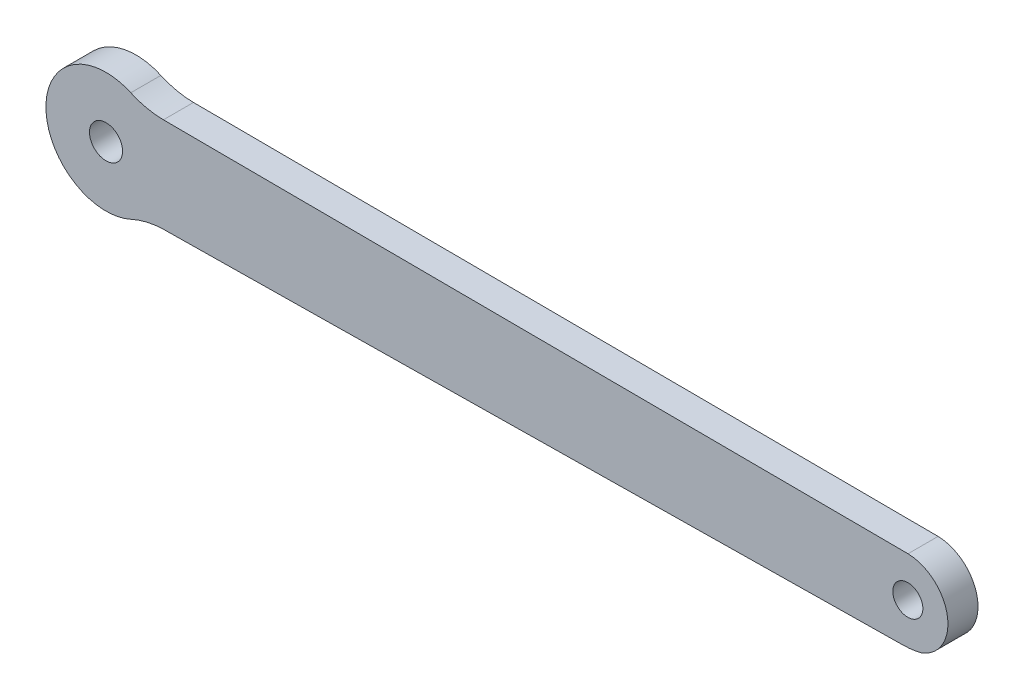
ISO-10303-21;
HEADER;
FILE_DESCRIPTION(('STEP AP214'),'2;1');
FILE_NAME('part.step','',(''),(''),'','','');
FILE_SCHEMA(('AUTOMOTIVE_DESIGN { 1 0 10303 214 1 1 1 1 }'));
ENDSEC;
DATA;
#1=APPLICATION_CONTEXT('core data for automotive mechanical design processes');
#2=APPLICATION_PROTOCOL_DEFINITION('international standard','automotive_design',2000,#1);
#3=PRODUCT_CONTEXT('',#1,'mechanical');
#4=PRODUCT('Part','Part','',(#3));
#5=PRODUCT_RELATED_PRODUCT_CATEGORY('part','',(#4));
#6=PRODUCT_DEFINITION_FORMATION('','',#4);
#7=PRODUCT_DEFINITION_CONTEXT('part definition',#1,'design');
#8=PRODUCT_DEFINITION('design','',#6,#7);
#9=PRODUCT_DEFINITION_SHAPE('','',#8);
#10=(LENGTH_UNIT() NAMED_UNIT(*) SI_UNIT(.MILLI.,.METRE.));
#11=(NAMED_UNIT(*) PLANE_ANGLE_UNIT() SI_UNIT($,.RADIAN.));
#12=(NAMED_UNIT(*) SI_UNIT($,.STERADIAN.) SOLID_ANGLE_UNIT());
#13=UNCERTAINTY_MEASURE_WITH_UNIT(LENGTH_MEASURE(1.E-05),#10,'distance_accuracy_value','');
#14=(GEOMETRIC_REPRESENTATION_CONTEXT(3) GLOBAL_UNCERTAINTY_ASSIGNED_CONTEXT((#13)) GLOBAL_UNIT_ASSIGNED_CONTEXT((#10,
#11,#12)) REPRESENTATION_CONTEXT('',''));
#15=CARTESIAN_POINT('',(0.,0.,0.));
#16=DIRECTION('',(0.,0.,1.));
#17=DIRECTION('',(1.,0.,0.));
#18=AXIS2_PLACEMENT_3D('',#15,#16,#17);
#19=CARTESIAN_POINT('',(28.7960181051384,23.1424698521259,3.));
#20=DIRECTION('',(0.,0.,-1.));
#21=DIRECTION('',(-1.,0.,0.));
#22=AXIS2_PLACEMENT_3D('',#19,#20,#21);
#23=CYLINDRICAL_SURFACE('',#22,7.99829648371094);
#24=CARTESIAN_POINT('',(28.7960181051384,23.1424698521259,0.));
#25=DIRECTION('',(0.,0.,1.));
#26=DIRECTION('',(1.,0.,0.));
#27=AXIS2_PLACEMENT_3D('',#24,#25,#26);
#28=CIRCLE('',#27,7.99829648371094);
#29=CARTESIAN_POINT('',(28.6495819210993,31.1394287135984,0.));
#30=VERTEX_POINT('',#29);
#31=CARTESIAN_POINT('',(25.4288854606647,30.3974794590018,0.));
#32=VERTEX_POINT('',#31);
#33=EDGE_CURVE('E128',#30,#32,#28,.T.);
#34=ORIENTED_EDGE('',*,*,#33,.F.);
#35=DIRECTION('',(0.,0.,-1.));
#36=VECTOR('',#35,1.);
#37=CARTESIAN_POINT('',(28.6495819210993,31.1394287135984,3.));
#38=LINE('',#37,#36);
#39=CARTESIAN_POINT('',(28.6495819210993,31.1394287135984,3.));
#40=VERTEX_POINT('',#39);
#41=EDGE_CURVE('E11',#40,#30,#38,.T.);
#42=ORIENTED_EDGE('',*,*,#41,.F.);
#43=CARTESIAN_POINT('',(28.7960181051384,23.1424698521259,3.));
#44=DIRECTION('',(0.,0.,1.));
#45=DIRECTION('',(1.,0.,0.));
#46=AXIS2_PLACEMENT_3D('',#43,#44,#45);
#47=CIRCLE('',#46,7.99829648371094);
#48=CARTESIAN_POINT('',(25.4288854606647,30.3974794590018,3.));
#49=VERTEX_POINT('',#48);
#50=EDGE_CURVE('E148',#40,#49,#47,.T.);
#51=ORIENTED_EDGE('',*,*,#50,.T.);
#52=DIRECTION('',(0.,0.,-1.));
#53=VECTOR('',#52,1.);
#54=CARTESIAN_POINT('',(25.4288854606647,30.3974794590018,3.));
#55=LINE('',#54,#53);
#56=EDGE_CURVE('E80',#49,#32,#55,.T.);
#57=ORIENTED_EDGE('',*,*,#56,.T.);
#58=EDGE_LOOP('',(#34,#42,#51,#57));
#59=FACE_BOUND('',#58,.T.);
#60=ADVANCED_FACE('F33',(#59),#23,.F.);
#61=CARTESIAN_POINT('',(-0.404510242368986,30.7573187528013,3.));
#62=DIRECTION('',(-0.0131505371709675,0.99991352794735,0.));
#63=DIRECTION('',(-0.99991352794735,-0.0131505371709675,0.));
#64=AXIS2_PLACEMENT_3D('',#61,#62,#63);
#65=PLANE('',#64);
#66=DIRECTION('',(0.99991352794735,0.0131505371709675,0.));
#67=VECTOR('',#66,1.);
#68=CARTESIAN_POINT('',(-0.404510242368986,30.7573187528013,0.));
#69=LINE('',#68,#67);
#70=CARTESIAN_POINT('',(102.415919976177,32.1095795750942,0.));
#71=VERTEX_POINT('',#70);
#72=EDGE_CURVE('E131',#30,#71,#69,.T.);
#73=ORIENTED_EDGE('',*,*,#72,.T.);
#74=DIRECTION('',(0.,0.,-1.));
#75=VECTOR('',#74,1.);
#76=CARTESIAN_POINT('',(102.415919976177,32.1095795750942,3.));
#77=LINE('',#76,#75);
#78=CARTESIAN_POINT('',(102.415919976177,32.1095795750942,3.));
#79=VERTEX_POINT('',#78);
#80=EDGE_CURVE('E41',#79,#71,#77,.T.);
#81=ORIENTED_EDGE('',*,*,#80,.F.);
#82=DIRECTION('',(0.99991352794735,0.0131505371709675,0.));
#83=VECTOR('',#82,1.);
#84=CARTESIAN_POINT('',(-0.404510242368986,30.7573187528013,3.));
#85=LINE('',#84,#83);
#86=EDGE_CURVE('E170',#40,#79,#85,.T.);
#87=ORIENTED_EDGE('',*,*,#86,.F.);
#88=ORIENTED_EDGE('',*,*,#41,.T.);
#89=EDGE_LOOP('',(#73,#81,#87,#88));
#90=FACE_BOUND('',#89,.T.);
#91=ADVANCED_FACE('F174',(#90),#65,.F.);
#92=CARTESIAN_POINT('',(102.31053594311,40.1095099344908,3.));
#93=DIRECTION('',(0.,0.,-1.));
#94=DIRECTION('',(-1.,0.,0.));
#95=AXIS2_PLACEMENT_3D('',#92,#93,#94);
#96=CYLINDRICAL_SURFACE('',#95,8.00062444748034);
#97=CARTESIAN_POINT('',(102.31053594311,40.1095099344908,0.));
#98=DIRECTION('',(0.,0.,1.));
#99=DIRECTION('',(1.,0.,0.));
#100=AXIS2_PLACEMENT_3D('',#97,#98,#99);
#101=CIRCLE('',#100,8.00062444748034);
#102=CARTESIAN_POINT('',(104.25489885047,32.3487467997144,0.));
#103=VERTEX_POINT('',#102);
#104=EDGE_CURVE('E133',#71,#103,#101,.T.);
#105=ORIENTED_EDGE('',*,*,#104,.T.);
#106=DIRECTION('',(0.,0.,-1.));
#107=VECTOR('',#106,1.);
#108=CARTESIAN_POINT('',(104.25489885047,32.3487467997144,3.));
#109=LINE('',#108,#107);
#110=CARTESIAN_POINT('',(104.25489885047,32.3487467997144,3.));
#111=VERTEX_POINT('',#110);
#112=EDGE_CURVE('E152',#111,#103,#109,.T.);
#113=ORIENTED_EDGE('',*,*,#112,.F.);
#114=CARTESIAN_POINT('',(102.31053594311,40.1095099344908,3.));
#115=DIRECTION('',(0.,0.,1.));
#116=DIRECTION('',(1.,0.,0.));
#117=AXIS2_PLACEMENT_3D('',#114,#115,#116);
#118=CIRCLE('',#117,8.00062444748034);
#119=EDGE_CURVE('E161',#79,#111,#118,.T.);
#120=ORIENTED_EDGE('',*,*,#119,.F.);
#121=ORIENTED_EDGE('',*,*,#80,.T.);
#122=EDGE_LOOP('',(#105,#113,#120,#121));
#123=FACE_BOUND('',#122,.T.);
#124=ADVANCED_FACE('F159',(#123),#96,.T.);
#125=CARTESIAN_POINT('',(102.82294342322,36.169561505317,3.));
#126=DIRECTION('',(0.,0.,-1.));
#127=DIRECTION('',(-1.,0.,0.));
#128=AXIS2_PLACEMENT_3D('',#125,#126,#127);
#129=CYLINDRICAL_SURFACE('',#128,4.08033348639285);
#130=CARTESIAN_POINT('',(102.82294342322,36.169561505317,0.));
#131=DIRECTION('',(0.,0.,1.));
#132=DIRECTION('',(1.,0.,0.));
#133=AXIS2_PLACEMENT_3D('',#130,#131,#132);
#134=CIRCLE('',#133,4.08033348639285);
#135=CARTESIAN_POINT('',(102.920968570382,40.2487173531245,0.));
#136=VERTEX_POINT('',#135);
#137=EDGE_CURVE('E135',#103,#136,#134,.T.);
#138=ORIENTED_EDGE('',*,*,#137,.T.);
#139=DIRECTION('',(0.,0.,-1.));
#140=VECTOR('',#139,1.);
#141=CARTESIAN_POINT('',(102.920968570382,40.2487173531245,3.));
#142=LINE('',#141,#140);
#143=CARTESIAN_POINT('',(102.920968570382,40.2487173531245,3.));
#144=VERTEX_POINT('',#143);
#145=EDGE_CURVE('E115',#144,#136,#142,.T.);
#146=ORIENTED_EDGE('',*,*,#145,.F.);
#147=CARTESIAN_POINT('',(102.82294342322,36.169561505317,3.));
#148=DIRECTION('',(0.,0.,1.));
#149=DIRECTION('',(1.,0.,0.));
#150=AXIS2_PLACEMENT_3D('',#147,#148,#149);
#151=CIRCLE('',#150,4.08033348639285);
#152=EDGE_CURVE('E102',#111,#144,#151,.T.);
#153=ORIENTED_EDGE('',*,*,#152,.F.);
#154=ORIENTED_EDGE('',*,*,#112,.T.);
#155=EDGE_LOOP('',(#138,#146,#153,#154));
#156=FACE_BOUND('',#155,.T.);
#157=ADVANCED_FACE('F169',(#156),#129,.T.);
#158=CARTESIAN_POINT('',(0.191950313107611,40.732820030158,3.));
#159=DIRECTION('',(-0.00471237153937729,-0.999988896715596,0.));
#160=DIRECTION('',(0.999988896715596,-0.00471237153937729,0.));
#161=AXIS2_PLACEMENT_3D('',#158,#159,#160);
#162=PLANE('',#161);
#163=DIRECTION('',(-0.999988896715596,0.00471237153937729,0.));
#164=VECTOR('',#163,1.);
#165=CARTESIAN_POINT('',(0.191950313107611,40.732820030158,0.));
#166=LINE('',#165,#164);
#167=CARTESIAN_POINT('',(28.6285934689113,40.5988145143738,0.));
#168=VERTEX_POINT('',#167);
#169=EDGE_CURVE('E111',#136,#168,#166,.T.);
#170=ORIENTED_EDGE('',*,*,#169,.T.);
#171=DIRECTION('',(0.,0.,-1.));
#172=VECTOR('',#171,1.);
#173=CARTESIAN_POINT('',(28.6285934689113,40.5988145143738,3.));
#174=LINE('',#173,#172);
#175=CARTESIAN_POINT('',(28.6285934689113,40.5988145143738,3.));
#176=VERTEX_POINT('',#175);
#177=EDGE_CURVE('E108',#176,#168,#174,.T.);
#178=ORIENTED_EDGE('',*,*,#177,.F.);
#179=DIRECTION('',(-0.999988896715596,0.00471237153937729,0.));
#180=VECTOR('',#179,1.);
#181=CARTESIAN_POINT('',(0.191950313107611,40.732820030158,3.));
#182=LINE('',#181,#180);
#183=EDGE_CURVE('E95',#144,#176,#182,.T.);
#184=ORIENTED_EDGE('',*,*,#183,.F.);
#185=ORIENTED_EDGE('',*,*,#145,.T.);
#186=EDGE_LOOP('',(#170,#178,#184,#185));
#187=FACE_BOUND('',#186,.T.);
#188=ADVANCED_FACE('F109',(#187),#162,.F.);
#189=CARTESIAN_POINT('',(28.6665529078563,48.599127905849,3.));
#190=DIRECTION('',(0.,0.,-1.));
#191=DIRECTION('',(-1.,0.,0.));
#192=AXIS2_PLACEMENT_3D('',#189,#190,#191);
#193=CYLINDRICAL_SURFACE('',#192,8.00040344487837);
#194=CARTESIAN_POINT('',(28.6665529078563,48.599127905849,0.));
#195=DIRECTION('',(0.,0.,1.));
#196=DIRECTION('',(1.,0.,0.));
#197=AXIS2_PLACEMENT_3D('',#194,#195,#196);
#198=CIRCLE('',#197,8.00040344487837);
#199=CARTESIAN_POINT('',(25.3730995669058,41.3080634861772,0.));
#200=VERTEX_POINT('',#199);
#201=EDGE_CURVE('E138',#200,#168,#198,.T.);
#202=ORIENTED_EDGE('',*,*,#201,.F.);
#203=DIRECTION('',(0.,0.,-1.));
#204=VECTOR('',#203,1.);
#205=CARTESIAN_POINT('',(25.3730995669058,41.3080634861772,3.));
#206=LINE('',#205,#204);
#207=CARTESIAN_POINT('',(25.3730995669058,41.3080634861772,3.));
#208=VERTEX_POINT('',#207);
#209=EDGE_CURVE('E73',#208,#200,#206,.T.);
#210=ORIENTED_EDGE('',*,*,#209,.F.);
#211=CARTESIAN_POINT('',(28.6665529078563,48.599127905849,3.));
#212=DIRECTION('',(0.,0.,1.));
#213=DIRECTION('',(1.,0.,0.));
#214=AXIS2_PLACEMENT_3D('',#211,#212,#213);
#215=CIRCLE('',#214,8.00040344487837);
#216=EDGE_CURVE('E100',#208,#176,#215,.T.);
#217=ORIENTED_EDGE('',*,*,#216,.T.);
#218=ORIENTED_EDGE('',*,*,#177,.T.);
#219=EDGE_LOOP('',(#202,#210,#217,#218));
#220=FACE_BOUND('',#219,.T.);
#221=ADVANCED_FACE('F117',(#220),#193,.F.);
#222=CARTESIAN_POINT('',(22.9032047933559,35.8400418350137,3.));
#223=DIRECTION('',(0.,0.,-1.));
#224=DIRECTION('',(-1.,0.,0.));
#225=AXIS2_PLACEMENT_3D('',#222,#223,#224);
#226=CYLINDRICAL_SURFACE('',#225,1.65);
#227=CARTESIAN_POINT('',(22.9032047933559,35.8400418350137,3.));
#228=DIRECTION('',(0.,0.,1.));
#229=DIRECTION('',(1.,0.,0.));
#230=AXIS2_PLACEMENT_3D('',#227,#228,#229);
#231=CIRCLE('',#230,1.65);
#232=CARTESIAN_POINT('',(24.5532047933559,35.8400418350137,3.));
#233=VERTEX_POINT('',#232);
#234=EDGE_CURVE('E119',#233,#233,#231,.T.);
#235=ORIENTED_EDGE('',*,*,#234,.T.);
#236=EDGE_LOOP('',(#235));
#237=FACE_BOUND('',#236,.T.);
#238=CARTESIAN_POINT('',(22.9032047933559,35.8400418350137,0.));
#239=DIRECTION('',(0.,0.,1.));
#240=DIRECTION('',(1.,0.,0.));
#241=AXIS2_PLACEMENT_3D('',#238,#239,#240);
#242=CIRCLE('',#241,1.65);
#243=CARTESIAN_POINT('',(24.5532047933559,35.8400418350137,0.));
#244=VERTEX_POINT('',#243);
#245=EDGE_CURVE('E142',#244,#244,#242,.T.);
#246=ORIENTED_EDGE('',*,*,#245,.F.);
#247=EDGE_LOOP('',(#246));
#248=FACE_BOUND('',#247,.T.);
#249=ADVANCED_FACE('F188',(#237,#248),#226,.F.);
#250=CARTESIAN_POINT('',(22.9031527293965,35.84,3.));
#251=DIRECTION('',(0.,0.,-1.));
#252=DIRECTION('',(-1.,0.,0.));
#253=AXIS2_PLACEMENT_3D('',#250,#251,#252);
#254=CYLINDRICAL_SURFACE('',#253,6.00002963900898);
#255=CARTESIAN_POINT('',(22.9031527293965,35.84,0.));
#256=DIRECTION('',(0.,0.,1.));
#257=DIRECTION('',(1.,0.,0.));
#258=AXIS2_PLACEMENT_3D('',#255,#256,#257);
#259=CIRCLE('',#258,6.00002963900898);
#260=EDGE_CURVE('E140',#200,#32,#259,.T.);
#261=ORIENTED_EDGE('',*,*,#260,.T.);
#262=ORIENTED_EDGE('',*,*,#56,.F.);
#263=CARTESIAN_POINT('',(22.9031527293965,35.84,3.));
#264=DIRECTION('',(0.,0.,1.));
#265=DIRECTION('',(1.,0.,0.));
#266=AXIS2_PLACEMENT_3D('',#263,#264,#265);
#267=CIRCLE('',#266,6.00002963900898);
#268=EDGE_CURVE('E49',#208,#49,#267,.T.);
#269=ORIENTED_EDGE('',*,*,#268,.F.);
#270=ORIENTED_EDGE('',*,*,#209,.T.);
#271=EDGE_LOOP('',(#261,#262,#269,#270));
#272=FACE_BOUND('',#271,.T.);
#273=ADVANCED_FACE('F189',(#272),#254,.T.);
#274=CARTESIAN_POINT('',(102.902119082566,36.2487617679354,3.));
#275=DIRECTION('',(0.,0.,-1.));
#276=DIRECTION('',(-1.,0.,0.));
#277=AXIS2_PLACEMENT_3D('',#274,#275,#276);
#278=CYLINDRICAL_SURFACE('',#277,1.5000000016666);
#279=CARTESIAN_POINT('',(102.902119082566,36.2487617679354,3.));
#280=DIRECTION('',(0.,0.,1.));
#281=DIRECTION('',(1.,0.,0.));
#282=AXIS2_PLACEMENT_3D('',#279,#280,#281);
#283=CIRCLE('',#282,1.5000000016666);
#284=CARTESIAN_POINT('',(104.402119084233,36.2487617679354,3.));
#285=VERTEX_POINT('',#284);
#286=EDGE_CURVE('E125',#285,#285,#283,.T.);
#287=ORIENTED_EDGE('',*,*,#286,.T.);
#288=EDGE_LOOP('',(#287));
#289=FACE_BOUND('',#288,.T.);
#290=CARTESIAN_POINT('',(102.902119082566,36.2487617679354,0.));
#291=DIRECTION('',(0.,0.,1.));
#292=DIRECTION('',(1.,0.,0.));
#293=AXIS2_PLACEMENT_3D('',#290,#291,#292);
#294=CIRCLE('',#293,1.5000000016666);
#295=CARTESIAN_POINT('',(104.402119084233,36.2487617679354,0.));
#296=VERTEX_POINT('',#295);
#297=EDGE_CURVE('E145',#296,#296,#294,.T.);
#298=ORIENTED_EDGE('',*,*,#297,.F.);
#299=EDGE_LOOP('',(#298));
#300=FACE_BOUND('',#299,.T.);
#301=ADVANCED_FACE('F192',(#289,#300),#278,.F.);
#302=CARTESIAN_POINT('',(0.,0.,3.));
#303=DIRECTION('',(0.,0.,1.));
#304=DIRECTION('',(1.,0.,0.));
#305=AXIS2_PLACEMENT_3D('',#302,#303,#304);
#306=PLANE('',#305);
#307=ORIENTED_EDGE('',*,*,#50,.F.);
#308=ORIENTED_EDGE('',*,*,#86,.T.);
#309=ORIENTED_EDGE('',*,*,#119,.T.);
#310=ORIENTED_EDGE('',*,*,#152,.T.);
#311=ORIENTED_EDGE('',*,*,#183,.T.);
#312=ORIENTED_EDGE('',*,*,#216,.F.);
#313=ORIENTED_EDGE('',*,*,#268,.T.);
#314=EDGE_LOOP('',(#307,#308,#309,#310,#311,#312,#313));
#315=FACE_BOUND('',#314,.T.);
#316=ORIENTED_EDGE('',*,*,#234,.F.);
#317=EDGE_LOOP('',(#316));
#318=FACE_BOUND('',#317,.T.);
#319=ORIENTED_EDGE('',*,*,#286,.F.);
#320=EDGE_LOOP('',(#319));
#321=FACE_BOUND('',#320,.T.);
#322=ADVANCED_FACE('F97',(#315,#318,#321),#306,.T.);
#323=CARTESIAN_POINT('',(0.,0.,0.));
#324=DIRECTION('',(0.,0.,1.));
#325=DIRECTION('',(1.,0.,0.));
#326=AXIS2_PLACEMENT_3D('',#323,#324,#325);
#327=PLANE('',#326);
#328=ORIENTED_EDGE('',*,*,#33,.T.);
#329=ORIENTED_EDGE('',*,*,#260,.F.);
#330=ORIENTED_EDGE('',*,*,#201,.T.);
#331=ORIENTED_EDGE('',*,*,#169,.F.);
#332=ORIENTED_EDGE('',*,*,#137,.F.);
#333=ORIENTED_EDGE('',*,*,#104,.F.);
#334=ORIENTED_EDGE('',*,*,#72,.F.);
#335=EDGE_LOOP('',(#328,#329,#330,#331,#332,#333,#334));
#336=FACE_BOUND('',#335,.T.);
#337=ORIENTED_EDGE('',*,*,#245,.T.);
#338=EDGE_LOOP('',(#337));
#339=FACE_BOUND('',#338,.T.);
#340=ORIENTED_EDGE('',*,*,#297,.T.);
#341=EDGE_LOOP('',(#340));
#342=FACE_BOUND('',#341,.T.);
#343=ADVANCED_FACE('F166',(#336,#339,#342),#327,.F.);
#344=CLOSED_SHELL('',(#60,#91,#124,#157,#188,#221,#249,#273,#301,#322,#343));
#345=MANIFOLD_SOLID_BREP('B2',#344);
#346=ADVANCED_BREP_SHAPE_REPRESENTATION('',(#18,#345),#14);
#347=SHAPE_DEFINITION_REPRESENTATION(#9,#346);
ENDSEC;
END-ISO-10303-21;
